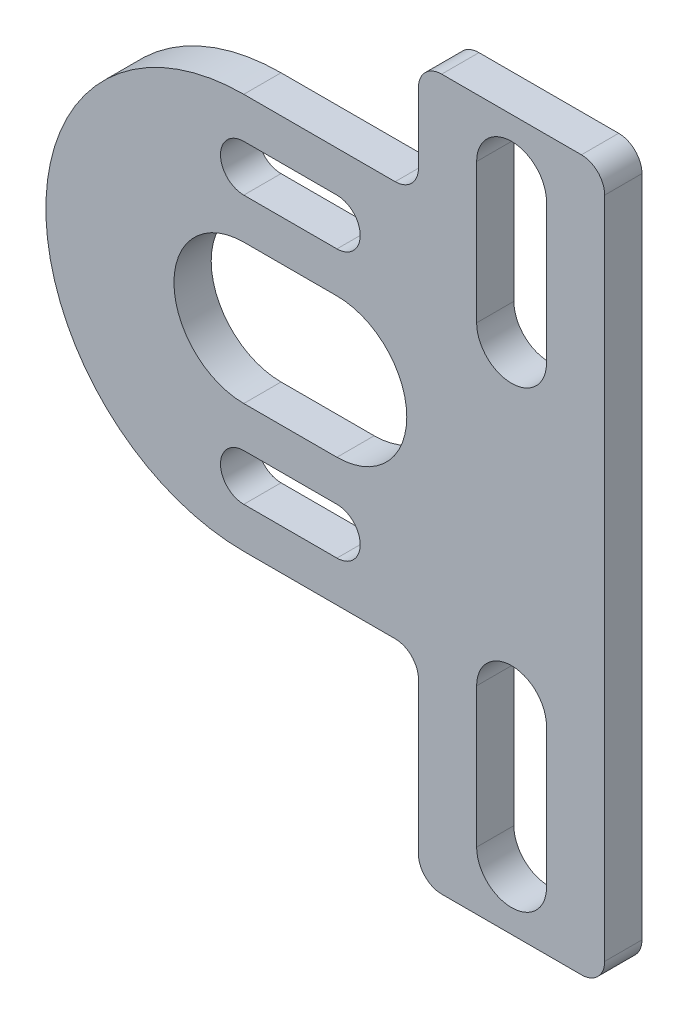
ISO-10303-21;
HEADER;
FILE_DESCRIPTION(('STEP AP214'),'2;1');
FILE_NAME('part.step','',(''),(''),'','','');
FILE_SCHEMA(('AUTOMOTIVE_DESIGN { 1 0 10303 214 1 1 1 1 }'));
ENDSEC;
DATA;
#1=APPLICATION_CONTEXT('core data for automotive mechanical design processes');
#2=APPLICATION_PROTOCOL_DEFINITION('international standard','automotive_design',2000,#1);
#3=PRODUCT_CONTEXT('',#1,'mechanical');
#4=PRODUCT('Part','Part','',(#3));
#5=PRODUCT_RELATED_PRODUCT_CATEGORY('part','',(#4));
#6=PRODUCT_DEFINITION_FORMATION('','',#4);
#7=PRODUCT_DEFINITION_CONTEXT('part definition',#1,'design');
#8=PRODUCT_DEFINITION('design','',#6,#7);
#9=PRODUCT_DEFINITION_SHAPE('','',#8);
#10=(LENGTH_UNIT() NAMED_UNIT(*) SI_UNIT(.MILLI.,.METRE.));
#11=(NAMED_UNIT(*) PLANE_ANGLE_UNIT() SI_UNIT($,.RADIAN.));
#12=(NAMED_UNIT(*) SI_UNIT($,.STERADIAN.) SOLID_ANGLE_UNIT());
#13=UNCERTAINTY_MEASURE_WITH_UNIT(LENGTH_MEASURE(1.E-05),#10,'distance_accuracy_value','');
#14=(GEOMETRIC_REPRESENTATION_CONTEXT(3) GLOBAL_UNCERTAINTY_ASSIGNED_CONTEXT((#13)) GLOBAL_UNIT_ASSIGNED_CONTEXT((#10,
#11,#12)) REPRESENTATION_CONTEXT('',''));
#15=CARTESIAN_POINT('',(0.,0.,0.));
#16=DIRECTION('',(0.,0.,1.));
#17=DIRECTION('',(1.,0.,0.));
#18=AXIS2_PLACEMENT_3D('',#15,#16,#17);
#19=CARTESIAN_POINT('',(-0.5,0.,1.6));
#20=DIRECTION('',(0.,0.,1.));
#21=DIRECTION('',(1.,0.,0.));
#22=AXIS2_PLACEMENT_3D('',#19,#20,#21);
#23=PLANE('',#22);
#24=DIRECTION('',(0.,-1.,0.));
#25=VECTOR('',#24,1.);
#26=CARTESIAN_POINT('',(9.50000000000001,-8.5,1.6));
#27=LINE('',#26,#25);
#28=CARTESIAN_POINT('',(9.50000000000001,-8.5,1.6));
#29=VERTEX_POINT('',#28);
#30=CARTESIAN_POINT('',(9.50000000000001,-14.5,1.6));
#31=VERTEX_POINT('',#30);
#32=EDGE_CURVE('E303',#29,#31,#27,.T.);
#33=ORIENTED_EDGE('',*,*,#32,.F.);
#34=CARTESIAN_POINT('',(11.,-8.5,1.6));
#35=DIRECTION('',(0.,0.,1.));
#36=DIRECTION('',(1.,0.,0.));
#37=AXIS2_PLACEMENT_3D('',#34,#35,#36);
#38=CIRCLE('',#37,1.5);
#39=CARTESIAN_POINT('',(12.5,-8.5,1.6));
#40=VERTEX_POINT('',#39);
#41=EDGE_CURVE('E301',#40,#29,#38,.T.);
#42=ORIENTED_EDGE('',*,*,#41,.F.);
#43=DIRECTION('',(0.,1.,0.));
#44=VECTOR('',#43,1.);
#45=CARTESIAN_POINT('',(12.5,-8.5,1.6));
#46=LINE('',#45,#44);
#47=CARTESIAN_POINT('',(12.5,-14.5,1.6));
#48=VERTEX_POINT('',#47);
#49=EDGE_CURVE('E309',#48,#40,#46,.T.);
#50=ORIENTED_EDGE('',*,*,#49,.F.);
#51=CARTESIAN_POINT('',(11.,-14.5,1.6));
#52=DIRECTION('',(0.,0.,1.));
#53=DIRECTION('',(1.,0.,0.));
#54=AXIS2_PLACEMENT_3D('',#51,#52,#53);
#55=CIRCLE('',#54,1.5);
#56=EDGE_CURVE('E306',#31,#48,#55,.T.);
#57=ORIENTED_EDGE('',*,*,#56,.F.);
#58=EDGE_LOOP('',(#33,#42,#50,#57));
#59=FACE_BOUND('',#58,.T.);
#60=DIRECTION('',(1.,0.,0.));
#61=VECTOR('',#60,1.);
#62=CARTESIAN_POINT('',(-0.500000000000001,-6.75,1.6));
#63=LINE('',#62,#61);
#64=CARTESIAN_POINT('',(-0.500000000000001,-6.75,1.6));
#65=VERTEX_POINT('',#64);
#66=CARTESIAN_POINT('',(3.5,-6.75,1.6));
#67=VERTEX_POINT('',#66);
#68=EDGE_CURVE('E365',#65,#67,#63,.T.);
#69=ORIENTED_EDGE('',*,*,#68,.F.);
#70=CARTESIAN_POINT('',(-0.500000000000001,-5.75,1.6));
#71=DIRECTION('',(0.,0.,1.));
#72=DIRECTION('',(-1.,0.,0.));
#73=AXIS2_PLACEMENT_3D('',#70,#71,#72);
#74=CIRCLE('',#73,1.);
#75=CARTESIAN_POINT('',(-0.500000000000001,-4.75,1.6));
#76=VERTEX_POINT('',#75);
#77=EDGE_CURVE('E363',#76,#65,#74,.T.);
#78=ORIENTED_EDGE('',*,*,#77,.F.);
#79=DIRECTION('',(-1.,0.,0.));
#80=VECTOR('',#79,1.);
#81=CARTESIAN_POINT('',(-0.500000000000001,-4.75,1.6));
#82=LINE('',#81,#80);
#83=CARTESIAN_POINT('',(3.5,-4.75,1.6));
#84=VERTEX_POINT('',#83);
#85=EDGE_CURVE('E371',#84,#76,#82,.T.);
#86=ORIENTED_EDGE('',*,*,#85,.F.);
#87=CARTESIAN_POINT('',(3.5,-5.75,1.6));
#88=DIRECTION('',(0.,0.,1.));
#89=DIRECTION('',(-1.,0.,0.));
#90=AXIS2_PLACEMENT_3D('',#87,#88,#89);
#91=CIRCLE('',#90,1.);
#92=EDGE_CURVE('E368',#67,#84,#91,.T.);
#93=ORIENTED_EDGE('',*,*,#92,.F.);
#94=EDGE_LOOP('',(#69,#78,#86,#93));
#95=FACE_BOUND('',#94,.T.);
#96=DIRECTION('',(0.,1.,0.));
#97=VECTOR('',#96,1.);
#98=CARTESIAN_POINT('',(15.,-17.,1.6));
#99=LINE('',#98,#97);
#100=CARTESIAN_POINT('',(15.,-16.,1.6));
#101=VERTEX_POINT('',#100);
#102=CARTESIAN_POINT('',(15.,12.5,1.6));
#103=VERTEX_POINT('',#102);
#104=EDGE_CURVE('E438',#101,#103,#99,.T.);
#105=ORIENTED_EDGE('',*,*,#104,.T.);
#106=CARTESIAN_POINT('',(14.,12.5,1.6));
#107=DIRECTION('',(0.,0.,1.));
#108=DIRECTION('',(1.,0.,0.));
#109=AXIS2_PLACEMENT_3D('',#106,#107,#108);
#110=CIRCLE('',#109,1.);
#111=CARTESIAN_POINT('',(14.,13.5,1.6));
#112=VERTEX_POINT('',#111);
#113=EDGE_CURVE('E498',#103,#112,#110,.T.);
#114=ORIENTED_EDGE('',*,*,#113,.T.);
#115=DIRECTION('',(-1.,0.,0.));
#116=VECTOR('',#115,1.);
#117=CARTESIAN_POINT('',(15.,13.5,1.6));
#118=LINE('',#117,#116);
#119=CARTESIAN_POINT('',(7.99999999999999,13.5,1.6));
#120=VERTEX_POINT('',#119);
#121=EDGE_CURVE('E441',#112,#120,#118,.T.);
#122=ORIENTED_EDGE('',*,*,#121,.T.);
#123=CARTESIAN_POINT('',(7.99999999999999,12.5,1.6));
#124=DIRECTION('',(0.,0.,1.));
#125=DIRECTION('',(1.,0.,0.));
#126=AXIS2_PLACEMENT_3D('',#123,#124,#125);
#127=CIRCLE('',#126,1.);
#128=CARTESIAN_POINT('',(6.99999999999999,12.5,1.6));
#129=VERTEX_POINT('',#128);
#130=EDGE_CURVE('E494',#120,#129,#127,.T.);
#131=ORIENTED_EDGE('',*,*,#130,.T.);
#132=DIRECTION('',(0.,-1.,0.));
#133=VECTOR('',#132,1.);
#134=CARTESIAN_POINT('',(6.99999999999999,13.5,1.6));
#135=LINE('',#134,#133);
#136=CARTESIAN_POINT('',(7.,9.5,1.6));
#137=VERTEX_POINT('',#136);
#138=EDGE_CURVE('E444',#129,#137,#135,.T.);
#139=ORIENTED_EDGE('',*,*,#138,.T.);
#140=CARTESIAN_POINT('',(6.,9.5,1.6));
#141=DIRECTION('',(0.,0.,1.));
#142=DIRECTION('',(1.,0.,0.));
#143=AXIS2_PLACEMENT_3D('',#140,#141,#142);
#144=CIRCLE('',#143,1.);
#145=CARTESIAN_POINT('',(6.,8.5,1.6));
#146=VERTEX_POINT('',#145);
#147=EDGE_CURVE('E52',#137,#146,#144,.F.);
#148=ORIENTED_EDGE('',*,*,#147,.T.);
#149=DIRECTION('',(-1.,0.,0.));
#150=VECTOR('',#149,1.);
#151=CARTESIAN_POINT('',(-0.5,8.5,1.6));
#152=LINE('',#151,#150);
#153=CARTESIAN_POINT('',(-0.5,8.5,1.6));
#154=VERTEX_POINT('',#153);
#155=EDGE_CURVE('E446',#146,#154,#152,.T.);
#156=ORIENTED_EDGE('',*,*,#155,.T.);
#157=CARTESIAN_POINT('',(-0.5,0.,1.6));
#158=DIRECTION('',(0.,0.,1.));
#159=DIRECTION('',(1.,0.,0.));
#160=AXIS2_PLACEMENT_3D('',#157,#158,#159);
#161=CIRCLE('',#160,8.5);
#162=CARTESIAN_POINT('',(-0.5,-8.5,1.6));
#163=VERTEX_POINT('',#162);
#164=EDGE_CURVE('E425',#154,#163,#161,.T.);
#165=ORIENTED_EDGE('',*,*,#164,.T.);
#166=DIRECTION('',(1.,0.,0.));
#167=VECTOR('',#166,1.);
#168=CARTESIAN_POINT('',(-0.5,-8.5,1.6));
#169=LINE('',#168,#167);
#170=CARTESIAN_POINT('',(6.,-8.5,1.6));
#171=VERTEX_POINT('',#170);
#172=EDGE_CURVE('E428',#163,#171,#169,.T.);
#173=ORIENTED_EDGE('',*,*,#172,.T.);
#174=CARTESIAN_POINT('',(6.,-9.5,1.6));
#175=DIRECTION('',(0.,0.,1.));
#176=DIRECTION('',(1.,0.,0.));
#177=AXIS2_PLACEMENT_3D('',#174,#175,#176);
#178=CIRCLE('',#177,1.);
#179=CARTESIAN_POINT('',(7.,-9.5,1.6));
#180=VERTEX_POINT('',#179);
#181=EDGE_CURVE('E11',#171,#180,#178,.F.);
#182=ORIENTED_EDGE('',*,*,#181,.T.);
#183=DIRECTION('',(0.,-1.,0.));
#184=VECTOR('',#183,1.);
#185=CARTESIAN_POINT('',(7.,-8.5,1.6));
#186=LINE('',#185,#184);
#187=CARTESIAN_POINT('',(7.,-16.,1.6));
#188=VERTEX_POINT('',#187);
#189=EDGE_CURVE('E432',#180,#188,#186,.T.);
#190=ORIENTED_EDGE('',*,*,#189,.T.);
#191=CARTESIAN_POINT('',(8.,-16.,1.6));
#192=DIRECTION('',(0.,0.,1.));
#193=DIRECTION('',(1.,0.,0.));
#194=AXIS2_PLACEMENT_3D('',#191,#192,#193);
#195=CIRCLE('',#194,1.);
#196=CARTESIAN_POINT('',(8.,-17.,1.6));
#197=VERTEX_POINT('',#196);
#198=EDGE_CURVE('E492',#188,#197,#195,.T.);
#199=ORIENTED_EDGE('',*,*,#198,.T.);
#200=DIRECTION('',(1.,0.,0.));
#201=VECTOR('',#200,1.);
#202=CARTESIAN_POINT('',(7.,-17.,1.6));
#203=LINE('',#202,#201);
#204=CARTESIAN_POINT('',(14.,-17.,1.6));
#205=VERTEX_POINT('',#204);
#206=EDGE_CURVE('E435',#197,#205,#203,.T.);
#207=ORIENTED_EDGE('',*,*,#206,.T.);
#208=CARTESIAN_POINT('',(14.,-16.,1.6));
#209=DIRECTION('',(0.,0.,1.));
#210=DIRECTION('',(1.,0.,0.));
#211=AXIS2_PLACEMENT_3D('',#208,#209,#210);
#212=CIRCLE('',#211,1.);
#213=EDGE_CURVE('E496',#205,#101,#212,.T.);
#214=ORIENTED_EDGE('',*,*,#213,.T.);
#215=EDGE_LOOP('',(#105,#114,#122,#131,#139,#148,#156,#165,#173,#182,#190,#199,#207,#214));
#216=FACE_BOUND('',#215,.T.);
#217=DIRECTION('',(1.,0.,0.));
#218=VECTOR('',#217,1.);
#219=CARTESIAN_POINT('',(-0.5,-3.,1.6));
#220=LINE('',#219,#218);
#221=CARTESIAN_POINT('',(-0.5,-3.,1.6));
#222=VERTEX_POINT('',#221);
#223=CARTESIAN_POINT('',(3.5,-3.,1.6));
#224=VERTEX_POINT('',#223);
#225=EDGE_CURVE('E396',#222,#224,#220,.T.);
#226=ORIENTED_EDGE('',*,*,#225,.F.);
#227=CARTESIAN_POINT('',(-0.5,0.,1.6));
#228=DIRECTION('',(0.,0.,1.));
#229=DIRECTION('',(1.,0.,0.));
#230=AXIS2_PLACEMENT_3D('',#227,#228,#229);
#231=CIRCLE('',#230,3.);
#232=CARTESIAN_POINT('',(-0.5,3.,1.6));
#233=VERTEX_POINT('',#232);
#234=EDGE_CURVE('E394',#233,#222,#231,.T.);
#235=ORIENTED_EDGE('',*,*,#234,.F.);
#236=DIRECTION('',(-1.,0.,0.));
#237=VECTOR('',#236,1.);
#238=CARTESIAN_POINT('',(-0.5,3.,1.6));
#239=LINE('',#238,#237);
#240=CARTESIAN_POINT('',(3.5,3.,1.6));
#241=VERTEX_POINT('',#240);
#242=EDGE_CURVE('E402',#241,#233,#239,.T.);
#243=ORIENTED_EDGE('',*,*,#242,.F.);
#244=CARTESIAN_POINT('',(3.5,0.,1.6));
#245=DIRECTION('',(0.,0.,1.));
#246=DIRECTION('',(-1.,0.,0.));
#247=AXIS2_PLACEMENT_3D('',#244,#245,#246);
#248=CIRCLE('',#247,3.);
#249=EDGE_CURVE('E399',#224,#241,#248,.T.);
#250=ORIENTED_EDGE('',*,*,#249,.F.);
#251=EDGE_LOOP('',(#226,#235,#243,#250));
#252=FACE_BOUND('',#251,.T.);
#253=DIRECTION('',(1.,0.,0.));
#254=VECTOR('',#253,1.);
#255=CARTESIAN_POINT('',(-0.500000000000001,4.75,1.6));
#256=LINE('',#255,#254);
#257=CARTESIAN_POINT('',(-0.500000000000001,4.75,1.6));
#258=VERTEX_POINT('',#257);
#259=CARTESIAN_POINT('',(3.5,4.75,1.6));
#260=VERTEX_POINT('',#259);
#261=EDGE_CURVE('E334',#258,#260,#256,.T.);
#262=ORIENTED_EDGE('',*,*,#261,.F.);
#263=CARTESIAN_POINT('',(-0.500000000000001,5.75,1.6));
#264=DIRECTION('',(0.,0.,1.));
#265=DIRECTION('',(1.,0.,0.));
#266=AXIS2_PLACEMENT_3D('',#263,#264,#265);
#267=CIRCLE('',#266,1.);
#268=CARTESIAN_POINT('',(-0.500000000000001,6.75,1.6));
#269=VERTEX_POINT('',#268);
#270=EDGE_CURVE('E332',#269,#258,#267,.T.);
#271=ORIENTED_EDGE('',*,*,#270,.F.);
#272=DIRECTION('',(-1.,0.,0.));
#273=VECTOR('',#272,1.);
#274=CARTESIAN_POINT('',(-0.500000000000001,6.75,1.6));
#275=LINE('',#274,#273);
#276=CARTESIAN_POINT('',(3.5,6.75,1.6));
#277=VERTEX_POINT('',#276);
#278=EDGE_CURVE('E340',#277,#269,#275,.T.);
#279=ORIENTED_EDGE('',*,*,#278,.F.);
#280=CARTESIAN_POINT('',(3.5,5.75,1.6));
#281=DIRECTION('',(0.,0.,1.));
#282=DIRECTION('',(1.,0.,0.));
#283=AXIS2_PLACEMENT_3D('',#280,#281,#282);
#284=CIRCLE('',#283,1.);
#285=EDGE_CURVE('E337',#260,#277,#284,.T.);
#286=ORIENTED_EDGE('',*,*,#285,.F.);
#287=EDGE_LOOP('',(#262,#271,#279,#286));
#288=FACE_BOUND('',#287,.T.);
#289=DIRECTION('',(0.,1.,0.));
#290=VECTOR('',#289,1.);
#291=CARTESIAN_POINT('',(12.5,5.,1.6));
#292=LINE('',#291,#290);
#293=CARTESIAN_POINT('',(12.5,5.,1.6));
#294=VERTEX_POINT('',#293);
#295=CARTESIAN_POINT('',(12.5,11.,1.6));
#296=VERTEX_POINT('',#295);
#297=EDGE_CURVE('E270',#294,#296,#292,.T.);
#298=ORIENTED_EDGE('',*,*,#297,.F.);
#299=CARTESIAN_POINT('',(11.,5.,1.6));
#300=DIRECTION('',(0.,0.,1.));
#301=DIRECTION('',(-1.,0.,0.));
#302=AXIS2_PLACEMENT_3D('',#299,#300,#301);
#303=CIRCLE('',#302,1.50000000000002);
#304=CARTESIAN_POINT('',(9.49999999999999,5.,1.6));
#305=VERTEX_POINT('',#304);
#306=EDGE_CURVE('E260',#305,#294,#303,.T.);
#307=ORIENTED_EDGE('',*,*,#306,.F.);
#308=DIRECTION('',(0.,-1.,0.));
#309=VECTOR('',#308,1.);
#310=CARTESIAN_POINT('',(9.49999999999999,5.,1.6));
#311=LINE('',#310,#309);
#312=CARTESIAN_POINT('',(9.49999999999999,11.,1.6));
#313=VERTEX_POINT('',#312);
#314=EDGE_CURVE('E285',#313,#305,#311,.T.);
#315=ORIENTED_EDGE('',*,*,#314,.F.);
#316=CARTESIAN_POINT('',(11.,11.,1.6));
#317=DIRECTION('',(0.,0.,1.));
#318=DIRECTION('',(-1.,0.,0.));
#319=AXIS2_PLACEMENT_3D('',#316,#317,#318);
#320=CIRCLE('',#319,1.50000000000002);
#321=EDGE_CURVE('E283',#296,#313,#320,.T.);
#322=ORIENTED_EDGE('',*,*,#321,.F.);
#323=EDGE_LOOP('',(#298,#307,#315,#322));
#324=FACE_BOUND('',#323,.T.);
#325=ADVANCED_FACE('F37',(#59,#95,#216,#252,#288,#324),#23,.T.);
#326=CARTESIAN_POINT('',(-0.5,0.,0.));
#327=DIRECTION('',(0.,0.,1.));
#328=DIRECTION('',(1.,0.,0.));
#329=AXIS2_PLACEMENT_3D('',#326,#327,#328);
#330=PLANE('',#329);
#331=CARTESIAN_POINT('',(11.,-8.5,0.));
#332=DIRECTION('',(0.,0.,1.));
#333=DIRECTION('',(1.,0.,0.));
#334=AXIS2_PLACEMENT_3D('',#331,#332,#333);
#335=CIRCLE('',#334,1.5);
#336=CARTESIAN_POINT('',(12.5,-8.5,0.));
#337=VERTEX_POINT('',#336);
#338=CARTESIAN_POINT('',(9.50000000000001,-8.5,0.));
#339=VERTEX_POINT('',#338);
#340=EDGE_CURVE('E278',#337,#339,#335,.T.);
#341=ORIENTED_EDGE('',*,*,#340,.T.);
#342=DIRECTION('',(0.,-1.,0.));
#343=VECTOR('',#342,1.);
#344=CARTESIAN_POINT('',(9.50000000000001,-8.5,0.));
#345=LINE('',#344,#343);
#346=CARTESIAN_POINT('',(9.50000000000001,-14.5,0.));
#347=VERTEX_POINT('',#346);
#348=EDGE_CURVE('E314',#339,#347,#345,.T.);
#349=ORIENTED_EDGE('',*,*,#348,.T.);
#350=CARTESIAN_POINT('',(11.,-14.5,0.));
#351=DIRECTION('',(0.,0.,1.));
#352=DIRECTION('',(1.,0.,0.));
#353=AXIS2_PLACEMENT_3D('',#350,#351,#352);
#354=CIRCLE('',#353,1.5);
#355=CARTESIAN_POINT('',(12.5,-14.5,0.));
#356=VERTEX_POINT('',#355);
#357=EDGE_CURVE('E317',#347,#356,#354,.T.);
#358=ORIENTED_EDGE('',*,*,#357,.T.);
#359=DIRECTION('',(0.,1.,0.));
#360=VECTOR('',#359,1.);
#361=CARTESIAN_POINT('',(12.5,-8.5,0.));
#362=LINE('',#361,#360);
#363=EDGE_CURVE('E304',#356,#337,#362,.T.);
#364=ORIENTED_EDGE('',*,*,#363,.T.);
#365=EDGE_LOOP('',(#341,#349,#358,#364));
#366=FACE_BOUND('',#365,.T.);
#367=CARTESIAN_POINT('',(-0.500000000000001,-5.75,0.));
#368=DIRECTION('',(0.,0.,1.));
#369=DIRECTION('',(-1.,0.,0.));
#370=AXIS2_PLACEMENT_3D('',#367,#368,#369);
#371=CIRCLE('',#370,1.);
#372=CARTESIAN_POINT('',(-0.500000000000001,-4.75,0.));
#373=VERTEX_POINT('',#372);
#374=CARTESIAN_POINT('',(-0.500000000000001,-6.75,0.));
#375=VERTEX_POINT('',#374);
#376=EDGE_CURVE('E362',#373,#375,#371,.T.);
#377=ORIENTED_EDGE('',*,*,#376,.T.);
#378=DIRECTION('',(1.,0.,0.));
#379=VECTOR('',#378,1.);
#380=CARTESIAN_POINT('',(-0.500000000000001,-6.75,0.));
#381=LINE('',#380,#379);
#382=CARTESIAN_POINT('',(3.5,-6.75,0.));
#383=VERTEX_POINT('',#382);
#384=EDGE_CURVE('E376',#375,#383,#381,.T.);
#385=ORIENTED_EDGE('',*,*,#384,.T.);
#386=CARTESIAN_POINT('',(3.5,-5.75,0.));
#387=DIRECTION('',(0.,0.,1.));
#388=DIRECTION('',(-1.,0.,0.));
#389=AXIS2_PLACEMENT_3D('',#386,#387,#388);
#390=CIRCLE('',#389,1.);
#391=CARTESIAN_POINT('',(3.5,-4.75,0.));
#392=VERTEX_POINT('',#391);
#393=EDGE_CURVE('E379',#383,#392,#390,.T.);
#394=ORIENTED_EDGE('',*,*,#393,.T.);
#395=DIRECTION('',(-1.,0.,0.));
#396=VECTOR('',#395,1.);
#397=CARTESIAN_POINT('',(-0.500000000000001,-4.75,0.));
#398=LINE('',#397,#396);
#399=EDGE_CURVE('E366',#392,#373,#398,.T.);
#400=ORIENTED_EDGE('',*,*,#399,.T.);
#401=EDGE_LOOP('',(#377,#385,#394,#400));
#402=FACE_BOUND('',#401,.T.);
#403=DIRECTION('',(-1.,0.,0.));
#404=VECTOR('',#403,1.);
#405=CARTESIAN_POINT('',(15.,13.5,0.));
#406=LINE('',#405,#404);
#407=CARTESIAN_POINT('',(14.,13.5,0.));
#408=VERTEX_POINT('',#407);
#409=CARTESIAN_POINT('',(7.99999999999999,13.5,0.));
#410=VERTEX_POINT('',#409);
#411=EDGE_CURVE('E463',#408,#410,#406,.T.);
#412=ORIENTED_EDGE('',*,*,#411,.F.);
#413=CARTESIAN_POINT('',(14.,12.5,0.));
#414=DIRECTION('',(0.,0.,1.));
#415=DIRECTION('',(1.,0.,0.));
#416=AXIS2_PLACEMENT_3D('',#413,#414,#415);
#417=CIRCLE('',#416,1.);
#418=CARTESIAN_POINT('',(15.,12.5,0.));
#419=VERTEX_POINT('',#418);
#420=EDGE_CURVE('E485',#408,#419,#417,.F.);
#421=ORIENTED_EDGE('',*,*,#420,.T.);
#422=DIRECTION('',(0.,1.,0.));
#423=VECTOR('',#422,1.);
#424=CARTESIAN_POINT('',(15.,-17.,0.));
#425=LINE('',#424,#423);
#426=CARTESIAN_POINT('',(15.,-16.,0.));
#427=VERTEX_POINT('',#426);
#428=EDGE_CURVE('E460',#427,#419,#425,.T.);
#429=ORIENTED_EDGE('',*,*,#428,.F.);
#430=CARTESIAN_POINT('',(14.,-16.,0.));
#431=DIRECTION('',(0.,0.,1.));
#432=DIRECTION('',(1.,0.,0.));
#433=AXIS2_PLACEMENT_3D('',#430,#431,#432);
#434=CIRCLE('',#433,1.);
#435=CARTESIAN_POINT('',(14.,-17.,0.));
#436=VERTEX_POINT('',#435);
#437=EDGE_CURVE('E483',#427,#436,#434,.F.);
#438=ORIENTED_EDGE('',*,*,#437,.T.);
#439=DIRECTION('',(1.,0.,0.));
#440=VECTOR('',#439,1.);
#441=CARTESIAN_POINT('',(7.,-17.,0.));
#442=LINE('',#441,#440);
#443=CARTESIAN_POINT('',(8.,-17.,0.));
#444=VERTEX_POINT('',#443);
#445=EDGE_CURVE('E457',#444,#436,#442,.T.);
#446=ORIENTED_EDGE('',*,*,#445,.F.);
#447=CARTESIAN_POINT('',(8.,-16.,0.));
#448=DIRECTION('',(0.,0.,1.));
#449=DIRECTION('',(1.,0.,0.));
#450=AXIS2_PLACEMENT_3D('',#447,#448,#449);
#451=CIRCLE('',#450,1.);
#452=CARTESIAN_POINT('',(7.,-16.,0.));
#453=VERTEX_POINT('',#452);
#454=EDGE_CURVE('E479',#444,#453,#451,.F.);
#455=ORIENTED_EDGE('',*,*,#454,.T.);
#456=DIRECTION('',(0.,-1.,0.));
#457=VECTOR('',#456,1.);
#458=CARTESIAN_POINT('',(7.,-8.5,0.));
#459=LINE('',#458,#457);
#460=CARTESIAN_POINT('',(7.,-9.5,0.));
#461=VERTEX_POINT('',#460);
#462=EDGE_CURVE('E454',#461,#453,#459,.T.);
#463=ORIENTED_EDGE('',*,*,#462,.F.);
#464=CARTESIAN_POINT('',(6.,-9.5,0.));
#465=DIRECTION('',(0.,0.,1.));
#466=DIRECTION('',(1.,0.,0.));
#467=AXIS2_PLACEMENT_3D('',#464,#465,#466);
#468=CIRCLE('',#467,1.);
#469=CARTESIAN_POINT('',(6.,-8.5,0.));
#470=VERTEX_POINT('',#469);
#471=EDGE_CURVE('E45',#461,#470,#468,.T.);
#472=ORIENTED_EDGE('',*,*,#471,.T.);
#473=DIRECTION('',(1.,0.,0.));
#474=VECTOR('',#473,1.);
#475=CARTESIAN_POINT('',(-0.5,-8.5,0.));
#476=LINE('',#475,#474);
#477=CARTESIAN_POINT('',(-0.5,-8.5,0.));
#478=VERTEX_POINT('',#477);
#479=EDGE_CURVE('E451',#478,#470,#476,.T.);
#480=ORIENTED_EDGE('',*,*,#479,.F.);
#481=CARTESIAN_POINT('',(-0.5,0.,0.));
#482=DIRECTION('',(0.,0.,1.));
#483=DIRECTION('',(1.,0.,0.));
#484=AXIS2_PLACEMENT_3D('',#481,#482,#483);
#485=CIRCLE('',#484,8.5);
#486=CARTESIAN_POINT('',(-0.5,8.5,0.));
#487=VERTEX_POINT('',#486);
#488=EDGE_CURVE('E424',#487,#478,#485,.T.);
#489=ORIENTED_EDGE('',*,*,#488,.F.);
#490=DIRECTION('',(-1.,0.,0.));
#491=VECTOR('',#490,1.);
#492=CARTESIAN_POINT('',(-0.5,8.5,0.));
#493=LINE('',#492,#491);
#494=CARTESIAN_POINT('',(6.,8.5,0.));
#495=VERTEX_POINT('',#494);
#496=EDGE_CURVE('E429',#495,#487,#493,.T.);
#497=ORIENTED_EDGE('',*,*,#496,.F.);
#498=CARTESIAN_POINT('',(6.,9.5,0.));
#499=DIRECTION('',(0.,0.,1.));
#500=DIRECTION('',(1.,0.,0.));
#501=AXIS2_PLACEMENT_3D('',#498,#499,#500);
#502=CIRCLE('',#501,1.);
#503=CARTESIAN_POINT('',(7.,9.5,0.));
#504=VERTEX_POINT('',#503);
#505=EDGE_CURVE('E519',#495,#504,#502,.T.);
#506=ORIENTED_EDGE('',*,*,#505,.T.);
#507=DIRECTION('',(0.,-1.,0.));
#508=VECTOR('',#507,1.);
#509=CARTESIAN_POINT('',(6.99999999999999,13.5,0.));
#510=LINE('',#509,#508);
#511=CARTESIAN_POINT('',(6.99999999999999,12.5,0.));
#512=VERTEX_POINT('',#511);
#513=EDGE_CURVE('E466',#512,#504,#510,.T.);
#514=ORIENTED_EDGE('',*,*,#513,.F.);
#515=CARTESIAN_POINT('',(7.99999999999999,12.5,0.));
#516=DIRECTION('',(0.,0.,1.));
#517=DIRECTION('',(1.,0.,0.));
#518=AXIS2_PLACEMENT_3D('',#515,#516,#517);
#519=CIRCLE('',#518,1.);
#520=EDGE_CURVE('E481',#512,#410,#519,.F.);
#521=ORIENTED_EDGE('',*,*,#520,.T.);
#522=EDGE_LOOP('',(#412,#421,#429,#438,#446,#455,#463,#472,#480,#489,#497,#506,#514,#521));
#523=FACE_BOUND('',#522,.T.);
#524=CARTESIAN_POINT('',(-0.5,0.,0.));
#525=DIRECTION('',(0.,0.,1.));
#526=DIRECTION('',(1.,0.,0.));
#527=AXIS2_PLACEMENT_3D('',#524,#525,#526);
#528=CIRCLE('',#527,3.);
#529=CARTESIAN_POINT('',(-0.5,3.,0.));
#530=VERTEX_POINT('',#529);
#531=CARTESIAN_POINT('',(-0.5,-3.,0.));
#532=VERTEX_POINT('',#531);
#533=EDGE_CURVE('E393',#530,#532,#528,.T.);
#534=ORIENTED_EDGE('',*,*,#533,.T.);
#535=DIRECTION('',(1.,0.,0.));
#536=VECTOR('',#535,1.);
#537=CARTESIAN_POINT('',(-0.5,-3.,0.));
#538=LINE('',#537,#536);
#539=CARTESIAN_POINT('',(3.5,-3.,0.));
#540=VERTEX_POINT('',#539);
#541=EDGE_CURVE('E407',#532,#540,#538,.T.);
#542=ORIENTED_EDGE('',*,*,#541,.T.);
#543=CARTESIAN_POINT('',(3.5,0.,0.));
#544=DIRECTION('',(0.,0.,1.));
#545=DIRECTION('',(-1.,0.,0.));
#546=AXIS2_PLACEMENT_3D('',#543,#544,#545);
#547=CIRCLE('',#546,3.);
#548=CARTESIAN_POINT('',(3.5,3.,0.));
#549=VERTEX_POINT('',#548);
#550=EDGE_CURVE('E410',#540,#549,#547,.T.);
#551=ORIENTED_EDGE('',*,*,#550,.T.);
#552=DIRECTION('',(-1.,0.,0.));
#553=VECTOR('',#552,1.);
#554=CARTESIAN_POINT('',(-0.5,3.,0.));
#555=LINE('',#554,#553);
#556=EDGE_CURVE('E397',#549,#530,#555,.T.);
#557=ORIENTED_EDGE('',*,*,#556,.T.);
#558=EDGE_LOOP('',(#534,#542,#551,#557));
#559=FACE_BOUND('',#558,.T.);
#560=CARTESIAN_POINT('',(-0.500000000000001,5.75,0.));
#561=DIRECTION('',(0.,0.,1.));
#562=DIRECTION('',(1.,0.,0.));
#563=AXIS2_PLACEMENT_3D('',#560,#561,#562);
#564=CIRCLE('',#563,1.);
#565=CARTESIAN_POINT('',(-0.500000000000001,6.75,0.));
#566=VERTEX_POINT('',#565);
#567=CARTESIAN_POINT('',(-0.500000000000001,4.75,0.));
#568=VERTEX_POINT('',#567);
#569=EDGE_CURVE('E331',#566,#568,#564,.T.);
#570=ORIENTED_EDGE('',*,*,#569,.T.);
#571=DIRECTION('',(1.,0.,0.));
#572=VECTOR('',#571,1.);
#573=CARTESIAN_POINT('',(-0.500000000000001,4.75,0.));
#574=LINE('',#573,#572);
#575=CARTESIAN_POINT('',(3.5,4.75,0.));
#576=VERTEX_POINT('',#575);
#577=EDGE_CURVE('E345',#568,#576,#574,.T.);
#578=ORIENTED_EDGE('',*,*,#577,.T.);
#579=CARTESIAN_POINT('',(3.5,5.75,0.));
#580=DIRECTION('',(0.,0.,1.));
#581=DIRECTION('',(1.,0.,0.));
#582=AXIS2_PLACEMENT_3D('',#579,#580,#581);
#583=CIRCLE('',#582,1.);
#584=CARTESIAN_POINT('',(3.5,6.75,0.));
#585=VERTEX_POINT('',#584);
#586=EDGE_CURVE('E348',#576,#585,#583,.T.);
#587=ORIENTED_EDGE('',*,*,#586,.T.);
#588=DIRECTION('',(-1.,0.,0.));
#589=VECTOR('',#588,1.);
#590=CARTESIAN_POINT('',(-0.500000000000001,6.75,0.));
#591=LINE('',#590,#589);
#592=EDGE_CURVE('E335',#585,#566,#591,.T.);
#593=ORIENTED_EDGE('',*,*,#592,.T.);
#594=EDGE_LOOP('',(#570,#578,#587,#593));
#595=FACE_BOUND('',#594,.T.);
#596=CARTESIAN_POINT('',(11.,5.,0.));
#597=DIRECTION('',(0.,0.,1.));
#598=DIRECTION('',(-1.,0.,0.));
#599=AXIS2_PLACEMENT_3D('',#596,#597,#598);
#600=CIRCLE('',#599,1.50000000000002);
#601=CARTESIAN_POINT('',(9.49999999999999,5.,0.));
#602=VERTEX_POINT('',#601);
#603=CARTESIAN_POINT('',(12.5,5.,0.));
#604=VERTEX_POINT('',#603);
#605=EDGE_CURVE('E289',#602,#604,#600,.T.);
#606=ORIENTED_EDGE('',*,*,#605,.T.);
#607=DIRECTION('',(0.,1.,0.));
#608=VECTOR('',#607,1.);
#609=CARTESIAN_POINT('',(12.5,5.,0.));
#610=LINE('',#609,#608);
#611=CARTESIAN_POINT('',(12.5,11.,0.));
#612=VERTEX_POINT('',#611);
#613=EDGE_CURVE('E277',#604,#612,#610,.T.);
#614=ORIENTED_EDGE('',*,*,#613,.T.);
#615=CARTESIAN_POINT('',(11.,11.,0.));
#616=DIRECTION('',(0.,0.,1.));
#617=DIRECTION('',(-1.,0.,0.));
#618=AXIS2_PLACEMENT_3D('',#615,#616,#617);
#619=CIRCLE('',#618,1.50000000000002);
#620=CARTESIAN_POINT('',(9.49999999999999,11.,0.));
#621=VERTEX_POINT('',#620);
#622=EDGE_CURVE('E292',#612,#621,#619,.T.);
#623=ORIENTED_EDGE('',*,*,#622,.T.);
#624=DIRECTION('',(0.,-1.,0.));
#625=VECTOR('',#624,1.);
#626=CARTESIAN_POINT('',(9.49999999999999,5.,0.));
#627=LINE('',#626,#625);
#628=EDGE_CURVE('E271',#621,#602,#627,.T.);
#629=ORIENTED_EDGE('',*,*,#628,.T.);
#630=EDGE_LOOP('',(#606,#614,#623,#629));
#631=FACE_BOUND('',#630,.T.);
#632=ADVANCED_FACE('F524',(#366,#402,#523,#559,#595,#631),#330,.F.);
#633=CARTESIAN_POINT('',(-0.5,0.,1.6));
#634=DIRECTION('',(0.,0.,-1.));
#635=DIRECTION('',(-1.,0.,0.));
#636=AXIS2_PLACEMENT_3D('',#633,#634,#635);
#637=CYLINDRICAL_SURFACE('',#636,8.5);
#638=ORIENTED_EDGE('',*,*,#488,.T.);
#639=DIRECTION('',(0.,0.,-1.));
#640=VECTOR('',#639,1.);
#641=CARTESIAN_POINT('',(-0.5,-8.5,1.6));
#642=LINE('',#641,#640);
#643=EDGE_CURVE('E471',#163,#478,#642,.T.);
#644=ORIENTED_EDGE('',*,*,#643,.F.);
#645=ORIENTED_EDGE('',*,*,#164,.F.);
#646=DIRECTION('',(0.,0.,-1.));
#647=VECTOR('',#646,1.);
#648=CARTESIAN_POINT('',(-0.5,8.5,1.6));
#649=LINE('',#648,#647);
#650=EDGE_CURVE('E448',#154,#487,#649,.T.);
#651=ORIENTED_EDGE('',*,*,#650,.T.);
#652=EDGE_LOOP('',(#638,#644,#645,#651));
#653=FACE_BOUND('',#652,.T.);
#654=ADVANCED_FACE('F580',(#653),#637,.T.);
#655=CARTESIAN_POINT('',(-0.5,-8.5,1.6));
#656=DIRECTION('',(0.,1.,0.));
#657=DIRECTION('',(0.,0.,1.));
#658=AXIS2_PLACEMENT_3D('',#655,#656,#657);
#659=PLANE('',#658);
#660=ORIENTED_EDGE('',*,*,#479,.T.);
#661=DIRECTION('',(0.,0.,-1.));
#662=VECTOR('',#661,1.);
#663=CARTESIAN_POINT('',(6.,-8.5,1.6));
#664=LINE('',#663,#662);
#665=EDGE_CURVE('E517',#470,#171,#664,.F.);
#666=ORIENTED_EDGE('',*,*,#665,.T.);
#667=ORIENTED_EDGE('',*,*,#172,.F.);
#668=ORIENTED_EDGE('',*,*,#643,.T.);
#669=EDGE_LOOP('',(#660,#666,#667,#668));
#670=FACE_BOUND('',#669,.T.);
#671=ADVANCED_FACE('F531',(#670),#659,.F.);
#672=CARTESIAN_POINT('',(7.,-8.5,1.6));
#673=DIRECTION('',(1.,0.,0.));
#674=DIRECTION('',(0.,1.,0.));
#675=AXIS2_PLACEMENT_3D('',#672,#673,#674);
#676=PLANE('',#675);
#677=ORIENTED_EDGE('',*,*,#462,.T.);
#678=DIRECTION('',(0.,0.,-1.));
#679=VECTOR('',#678,1.);
#680=CARTESIAN_POINT('',(7.,-16.,1.6));
#681=LINE('',#680,#679);
#682=EDGE_CURVE('E515',#453,#188,#681,.F.);
#683=ORIENTED_EDGE('',*,*,#682,.T.);
#684=ORIENTED_EDGE('',*,*,#189,.F.);
#685=DIRECTION('',(0.,0.,-1.));
#686=VECTOR('',#685,1.);
#687=CARTESIAN_POINT('',(7.,-9.5,0.));
#688=LINE('',#687,#686);
#689=EDGE_CURVE('E512',#180,#461,#688,.T.);
#690=ORIENTED_EDGE('',*,*,#689,.T.);
#691=EDGE_LOOP('',(#677,#683,#684,#690));
#692=FACE_BOUND('',#691,.T.);
#693=ADVANCED_FACE('F538',(#692),#676,.F.);
#694=CARTESIAN_POINT('',(7.,-17.,1.6));
#695=DIRECTION('',(0.,1.,0.));
#696=DIRECTION('',(0.,0.,1.));
#697=AXIS2_PLACEMENT_3D('',#694,#695,#696);
#698=PLANE('',#697);
#699=ORIENTED_EDGE('',*,*,#445,.T.);
#700=DIRECTION('',(0.,0.,-1.));
#701=VECTOR('',#700,1.);
#702=CARTESIAN_POINT('',(14.,-17.,1.6));
#703=LINE('',#702,#701);
#704=EDGE_CURVE('E503',#436,#205,#703,.F.);
#705=ORIENTED_EDGE('',*,*,#704,.T.);
#706=ORIENTED_EDGE('',*,*,#206,.F.);
#707=DIRECTION('',(0.,0.,-1.));
#708=VECTOR('',#707,1.);
#709=CARTESIAN_POINT('',(8.,-17.,1.6));
#710=LINE('',#709,#708);
#711=EDGE_CURVE('E500',#197,#444,#710,.T.);
#712=ORIENTED_EDGE('',*,*,#711,.T.);
#713=EDGE_LOOP('',(#699,#705,#706,#712));
#714=FACE_BOUND('',#713,.T.);
#715=ADVANCED_FACE('F546',(#714),#698,.F.);
#716=CARTESIAN_POINT('',(15.,-17.,1.6));
#717=DIRECTION('',(-1.,0.,0.));
#718=DIRECTION('',(0.,0.,1.));
#719=AXIS2_PLACEMENT_3D('',#716,#717,#718);
#720=PLANE('',#719);
#721=ORIENTED_EDGE('',*,*,#428,.T.);
#722=DIRECTION('',(0.,0.,-1.));
#723=VECTOR('',#722,1.);
#724=CARTESIAN_POINT('',(15.,12.5,1.6));
#725=LINE('',#724,#723);
#726=EDGE_CURVE('E490',#419,#103,#725,.F.);
#727=ORIENTED_EDGE('',*,*,#726,.T.);
#728=ORIENTED_EDGE('',*,*,#104,.F.);
#729=DIRECTION('',(0.,0.,-1.));
#730=VECTOR('',#729,1.);
#731=CARTESIAN_POINT('',(15.,-16.,1.6));
#732=LINE('',#731,#730);
#733=EDGE_CURVE('E487',#101,#427,#732,.T.);
#734=ORIENTED_EDGE('',*,*,#733,.T.);
#735=EDGE_LOOP('',(#721,#727,#728,#734));
#736=FACE_BOUND('',#735,.T.);
#737=ADVANCED_FACE('F555',(#736),#720,.F.);
#738=CARTESIAN_POINT('',(15.,13.5,1.6));
#739=DIRECTION('',(0.,-1.,0.));
#740=DIRECTION('',(0.,0.,-1.));
#741=AXIS2_PLACEMENT_3D('',#738,#739,#740);
#742=PLANE('',#741);
#743=ORIENTED_EDGE('',*,*,#121,.F.);
#744=DIRECTION('',(0.,0.,-1.));
#745=VECTOR('',#744,1.);
#746=CARTESIAN_POINT('',(14.,13.5,1.6));
#747=LINE('',#746,#745);
#748=EDGE_CURVE('E476',#112,#408,#747,.T.);
#749=ORIENTED_EDGE('',*,*,#748,.T.);
#750=ORIENTED_EDGE('',*,*,#411,.T.);
#751=DIRECTION('',(0.,0.,-1.));
#752=VECTOR('',#751,1.);
#753=CARTESIAN_POINT('',(7.99999999999999,13.5,1.6));
#754=LINE('',#753,#752);
#755=EDGE_CURVE('E474',#410,#120,#754,.F.);
#756=ORIENTED_EDGE('',*,*,#755,.T.);
#757=EDGE_LOOP('',(#743,#749,#750,#756));
#758=FACE_BOUND('',#757,.T.);
#759=ADVANCED_FACE('F564',(#758),#742,.F.);
#760=CARTESIAN_POINT('',(6.99999999999999,13.5,1.6));
#761=DIRECTION('',(1.,0.,0.));
#762=DIRECTION('',(0.,1.,0.));
#763=AXIS2_PLACEMENT_3D('',#760,#761,#762);
#764=PLANE('',#763);
#765=ORIENTED_EDGE('',*,*,#513,.T.);
#766=DIRECTION('',(0.,0.,-1.));
#767=VECTOR('',#766,1.);
#768=CARTESIAN_POINT('',(7.,9.5,1.6));
#769=LINE('',#768,#767);
#770=EDGE_CURVE('E60',#504,#137,#769,.F.);
#771=ORIENTED_EDGE('',*,*,#770,.T.);
#772=ORIENTED_EDGE('',*,*,#138,.F.);
#773=DIRECTION('',(0.,0.,-1.));
#774=VECTOR('',#773,1.);
#775=CARTESIAN_POINT('',(6.99999999999999,12.5,1.6));
#776=LINE('',#775,#774);
#777=EDGE_CURVE('E508',#129,#512,#776,.T.);
#778=ORIENTED_EDGE('',*,*,#777,.T.);
#779=EDGE_LOOP('',(#765,#771,#772,#778));
#780=FACE_BOUND('',#779,.T.);
#781=ADVANCED_FACE('F569',(#780),#764,.F.);
#782=CARTESIAN_POINT('',(-0.5,8.5,1.6));
#783=DIRECTION('',(0.,-1.,0.));
#784=DIRECTION('',(0.,0.,-1.));
#785=AXIS2_PLACEMENT_3D('',#782,#783,#784);
#786=PLANE('',#785);
#787=ORIENTED_EDGE('',*,*,#155,.F.);
#788=DIRECTION('',(0.,0.,-1.));
#789=VECTOR('',#788,1.);
#790=CARTESIAN_POINT('',(6.,8.5,0.));
#791=LINE('',#790,#789);
#792=EDGE_CURVE('E505',#146,#495,#791,.T.);
#793=ORIENTED_EDGE('',*,*,#792,.T.);
#794=ORIENTED_EDGE('',*,*,#496,.T.);
#795=ORIENTED_EDGE('',*,*,#650,.F.);
#796=EDGE_LOOP('',(#787,#793,#794,#795));
#797=FACE_BOUND('',#796,.T.);
#798=ADVANCED_FACE('F576',(#797),#786,.F.);
#799=CARTESIAN_POINT('',(-0.5,0.,1.6));
#800=DIRECTION('',(0.,0.,-1.));
#801=DIRECTION('',(-1.,0.,0.));
#802=AXIS2_PLACEMENT_3D('',#799,#800,#801);
#803=CYLINDRICAL_SURFACE('',#802,3.);
#804=ORIENTED_EDGE('',*,*,#533,.F.);
#805=DIRECTION('',(0.,0.,-1.));
#806=VECTOR('',#805,1.);
#807=CARTESIAN_POINT('',(-0.5,3.,1.6));
#808=LINE('',#807,#806);
#809=EDGE_CURVE('E404',#233,#530,#808,.T.);
#810=ORIENTED_EDGE('',*,*,#809,.F.);
#811=ORIENTED_EDGE('',*,*,#234,.T.);
#812=DIRECTION('',(0.,0.,-1.));
#813=VECTOR('',#812,1.);
#814=CARTESIAN_POINT('',(-0.5,-3.,1.6));
#815=LINE('',#814,#813);
#816=EDGE_CURVE('E421',#222,#532,#815,.T.);
#817=ORIENTED_EDGE('',*,*,#816,.T.);
#818=EDGE_LOOP('',(#804,#810,#811,#817));
#819=FACE_BOUND('',#818,.T.);
#820=ADVANCED_FACE('F599',(#819),#803,.F.);
#821=CARTESIAN_POINT('',(-0.5,-3.,1.6));
#822=DIRECTION('',(0.,1.,0.));
#823=DIRECTION('',(-1.,0.,0.));
#824=AXIS2_PLACEMENT_3D('',#821,#822,#823);
#825=PLANE('',#824);
#826=ORIENTED_EDGE('',*,*,#541,.F.);
#827=ORIENTED_EDGE('',*,*,#816,.F.);
#828=ORIENTED_EDGE('',*,*,#225,.T.);
#829=DIRECTION('',(0.,0.,-1.));
#830=VECTOR('',#829,1.);
#831=CARTESIAN_POINT('',(3.5,-3.,1.6));
#832=LINE('',#831,#830);
#833=EDGE_CURVE('E419',#224,#540,#832,.T.);
#834=ORIENTED_EDGE('',*,*,#833,.T.);
#835=EDGE_LOOP('',(#826,#827,#828,#834));
#836=FACE_BOUND('',#835,.T.);
#837=ADVANCED_FACE('F644',(#836),#825,.T.);
#838=CARTESIAN_POINT('',(3.5,0.,1.6));
#839=DIRECTION('',(0.,0.,-1.));
#840=DIRECTION('',(-1.,0.,0.));
#841=AXIS2_PLACEMENT_3D('',#838,#839,#840);
#842=CYLINDRICAL_SURFACE('',#841,3.);
#843=ORIENTED_EDGE('',*,*,#550,.F.);
#844=ORIENTED_EDGE('',*,*,#833,.F.);
#845=ORIENTED_EDGE('',*,*,#249,.T.);
#846=DIRECTION('',(0.,0.,-1.));
#847=VECTOR('',#846,1.);
#848=CARTESIAN_POINT('',(3.5,3.,1.6));
#849=LINE('',#848,#847);
#850=EDGE_CURVE('E417',#241,#549,#849,.T.);
#851=ORIENTED_EDGE('',*,*,#850,.T.);
#852=EDGE_LOOP('',(#843,#844,#845,#851));
#853=FACE_BOUND('',#852,.T.);
#854=ADVANCED_FACE('F651',(#853),#842,.F.);
#855=CARTESIAN_POINT('',(-0.5,3.,1.6));
#856=DIRECTION('',(0.,-1.,0.));
#857=DIRECTION('',(1.,0.,0.));
#858=AXIS2_PLACEMENT_3D('',#855,#856,#857);
#859=PLANE('',#858);
#860=ORIENTED_EDGE('',*,*,#556,.F.);
#861=ORIENTED_EDGE('',*,*,#850,.F.);
#862=ORIENTED_EDGE('',*,*,#242,.T.);
#863=ORIENTED_EDGE('',*,*,#809,.T.);
#864=EDGE_LOOP('',(#860,#861,#862,#863));
#865=FACE_BOUND('',#864,.T.);
#866=ADVANCED_FACE('F658',(#865),#859,.T.);
#867=CARTESIAN_POINT('',(-0.500000000000001,-5.75,1.6));
#868=DIRECTION('',(0.,0.,-1.));
#869=DIRECTION('',(-1.,0.,0.));
#870=AXIS2_PLACEMENT_3D('',#867,#868,#869);
#871=CYLINDRICAL_SURFACE('',#870,1.);
#872=ORIENTED_EDGE('',*,*,#376,.F.);
#873=DIRECTION('',(0.,0.,-1.));
#874=VECTOR('',#873,1.);
#875=CARTESIAN_POINT('',(-0.500000000000001,-4.75,1.6));
#876=LINE('',#875,#874);
#877=EDGE_CURVE('E373',#76,#373,#876,.T.);
#878=ORIENTED_EDGE('',*,*,#877,.F.);
#879=ORIENTED_EDGE('',*,*,#77,.T.);
#880=DIRECTION('',(0.,0.,-1.));
#881=VECTOR('',#880,1.);
#882=CARTESIAN_POINT('',(-0.500000000000001,-6.75,1.6));
#883=LINE('',#882,#881);
#884=EDGE_CURVE('E390',#65,#375,#883,.T.);
#885=ORIENTED_EDGE('',*,*,#884,.T.);
#886=EDGE_LOOP('',(#872,#878,#879,#885));
#887=FACE_BOUND('',#886,.T.);
#888=ADVANCED_FACE('F666',(#887),#871,.F.);
#889=CARTESIAN_POINT('',(-0.500000000000001,-6.75,1.6));
#890=DIRECTION('',(0.,1.,0.));
#891=DIRECTION('',(-1.,0.,0.));
#892=AXIS2_PLACEMENT_3D('',#889,#890,#891);
#893=PLANE('',#892);
#894=ORIENTED_EDGE('',*,*,#384,.F.);
#895=ORIENTED_EDGE('',*,*,#884,.F.);
#896=ORIENTED_EDGE('',*,*,#68,.T.);
#897=DIRECTION('',(0.,0.,-1.));
#898=VECTOR('',#897,1.);
#899=CARTESIAN_POINT('',(3.5,-6.75,1.6));
#900=LINE('',#899,#898);
#901=EDGE_CURVE('E388',#67,#383,#900,.T.);
#902=ORIENTED_EDGE('',*,*,#901,.T.);
#903=EDGE_LOOP('',(#894,#895,#896,#902));
#904=FACE_BOUND('',#903,.T.);
#905=ADVANCED_FACE('F674',(#904),#893,.T.);
#906=CARTESIAN_POINT('',(3.5,-5.75,1.6));
#907=DIRECTION('',(0.,0.,-1.));
#908=DIRECTION('',(-1.,0.,0.));
#909=AXIS2_PLACEMENT_3D('',#906,#907,#908);
#910=CYLINDRICAL_SURFACE('',#909,1.);
#911=ORIENTED_EDGE('',*,*,#393,.F.);
#912=ORIENTED_EDGE('',*,*,#901,.F.);
#913=ORIENTED_EDGE('',*,*,#92,.T.);
#914=DIRECTION('',(0.,0.,-1.));
#915=VECTOR('',#914,1.);
#916=CARTESIAN_POINT('',(3.5,-4.75,1.6));
#917=LINE('',#916,#915);
#918=EDGE_CURVE('E386',#84,#392,#917,.T.);
#919=ORIENTED_EDGE('',*,*,#918,.T.);
#920=EDGE_LOOP('',(#911,#912,#913,#919));
#921=FACE_BOUND('',#920,.T.);
#922=ADVANCED_FACE('F682',(#921),#910,.F.);
#923=CARTESIAN_POINT('',(-0.500000000000001,-4.75,1.6));
#924=DIRECTION('',(0.,-1.,0.));
#925=DIRECTION('',(1.,0.,0.));
#926=AXIS2_PLACEMENT_3D('',#923,#924,#925);
#927=PLANE('',#926);
#928=ORIENTED_EDGE('',*,*,#399,.F.);
#929=ORIENTED_EDGE('',*,*,#918,.F.);
#930=ORIENTED_EDGE('',*,*,#85,.T.);
#931=ORIENTED_EDGE('',*,*,#877,.T.);
#932=EDGE_LOOP('',(#928,#929,#930,#931));
#933=FACE_BOUND('',#932,.T.);
#934=ADVANCED_FACE('F690',(#933),#927,.T.);
#935=CARTESIAN_POINT('',(-0.500000000000001,5.75,1.6));
#936=DIRECTION('',(0.,0.,-1.));
#937=DIRECTION('',(-1.,0.,0.));
#938=AXIS2_PLACEMENT_3D('',#935,#936,#937);
#939=CYLINDRICAL_SURFACE('',#938,1.);
#940=ORIENTED_EDGE('',*,*,#569,.F.);
#941=DIRECTION('',(0.,0.,-1.));
#942=VECTOR('',#941,1.);
#943=CARTESIAN_POINT('',(-0.500000000000001,6.75,1.6));
#944=LINE('',#943,#942);
#945=EDGE_CURVE('E342',#269,#566,#944,.T.);
#946=ORIENTED_EDGE('',*,*,#945,.F.);
#947=ORIENTED_EDGE('',*,*,#270,.T.);
#948=DIRECTION('',(0.,0.,-1.));
#949=VECTOR('',#948,1.);
#950=CARTESIAN_POINT('',(-0.500000000000001,4.75,1.6));
#951=LINE('',#950,#949);
#952=EDGE_CURVE('E359',#258,#568,#951,.T.);
#953=ORIENTED_EDGE('',*,*,#952,.T.);
#954=EDGE_LOOP('',(#940,#946,#947,#953));
#955=FACE_BOUND('',#954,.T.);
#956=ADVANCED_FACE('F698',(#955),#939,.F.);
#957=CARTESIAN_POINT('',(-0.500000000000001,4.75,1.6));
#958=DIRECTION('',(0.,1.,0.));
#959=DIRECTION('',(-1.,0.,0.));
#960=AXIS2_PLACEMENT_3D('',#957,#958,#959);
#961=PLANE('',#960);
#962=ORIENTED_EDGE('',*,*,#577,.F.);
#963=ORIENTED_EDGE('',*,*,#952,.F.);
#964=ORIENTED_EDGE('',*,*,#261,.T.);
#965=DIRECTION('',(0.,0.,-1.));
#966=VECTOR('',#965,1.);
#967=CARTESIAN_POINT('',(3.5,4.75,1.6));
#968=LINE('',#967,#966);
#969=EDGE_CURVE('E357',#260,#576,#968,.T.);
#970=ORIENTED_EDGE('',*,*,#969,.T.);
#971=EDGE_LOOP('',(#962,#963,#964,#970));
#972=FACE_BOUND('',#971,.T.);
#973=ADVANCED_FACE('F706',(#972),#961,.T.);
#974=CARTESIAN_POINT('',(3.5,5.75,1.6));
#975=DIRECTION('',(0.,0.,-1.));
#976=DIRECTION('',(-1.,0.,0.));
#977=AXIS2_PLACEMENT_3D('',#974,#975,#976);
#978=CYLINDRICAL_SURFACE('',#977,1.);
#979=ORIENTED_EDGE('',*,*,#586,.F.);
#980=ORIENTED_EDGE('',*,*,#969,.F.);
#981=ORIENTED_EDGE('',*,*,#285,.T.);
#982=DIRECTION('',(0.,0.,-1.));
#983=VECTOR('',#982,1.);
#984=CARTESIAN_POINT('',(3.5,6.75,1.6));
#985=LINE('',#984,#983);
#986=EDGE_CURVE('E355',#277,#585,#985,.T.);
#987=ORIENTED_EDGE('',*,*,#986,.T.);
#988=EDGE_LOOP('',(#979,#980,#981,#987));
#989=FACE_BOUND('',#988,.T.);
#990=ADVANCED_FACE('F714',(#989),#978,.F.);
#991=CARTESIAN_POINT('',(-0.500000000000001,6.75,1.6));
#992=DIRECTION('',(0.,-1.,0.));
#993=DIRECTION('',(1.,0.,0.));
#994=AXIS2_PLACEMENT_3D('',#991,#992,#993);
#995=PLANE('',#994);
#996=ORIENTED_EDGE('',*,*,#592,.F.);
#997=ORIENTED_EDGE('',*,*,#986,.F.);
#998=ORIENTED_EDGE('',*,*,#278,.T.);
#999=ORIENTED_EDGE('',*,*,#945,.T.);
#1000=EDGE_LOOP('',(#996,#997,#998,#999));
#1001=FACE_BOUND('',#1000,.T.);
#1002=ADVANCED_FACE('F722',(#1001),#995,.T.);
#1003=CARTESIAN_POINT('',(11.,-8.5,1.6));
#1004=DIRECTION('',(0.,0.,-1.));
#1005=DIRECTION('',(-1.,0.,0.));
#1006=AXIS2_PLACEMENT_3D('',#1003,#1004,#1005);
#1007=CYLINDRICAL_SURFACE('',#1006,1.5);
#1008=ORIENTED_EDGE('',*,*,#340,.F.);
#1009=DIRECTION('',(0.,0.,-1.));
#1010=VECTOR('',#1009,1.);
#1011=CARTESIAN_POINT('',(12.5,-8.5,1.6));
#1012=LINE('',#1011,#1010);
#1013=EDGE_CURVE('E311',#40,#337,#1012,.T.);
#1014=ORIENTED_EDGE('',*,*,#1013,.F.);
#1015=ORIENTED_EDGE('',*,*,#41,.T.);
#1016=DIRECTION('',(0.,0.,-1.));
#1017=VECTOR('',#1016,1.);
#1018=CARTESIAN_POINT('',(9.50000000000001,-8.5,1.6));
#1019=LINE('',#1018,#1017);
#1020=EDGE_CURVE('E328',#29,#339,#1019,.T.);
#1021=ORIENTED_EDGE('',*,*,#1020,.T.);
#1022=EDGE_LOOP('',(#1008,#1014,#1015,#1021));
#1023=FACE_BOUND('',#1022,.T.);
#1024=ADVANCED_FACE('F730',(#1023),#1007,.F.);
#1025=CARTESIAN_POINT('',(9.50000000000001,-8.5,1.6));
#1026=DIRECTION('',(1.,0.,0.));
#1027=DIRECTION('',(0.,1.,0.));
#1028=AXIS2_PLACEMENT_3D('',#1025,#1026,#1027);
#1029=PLANE('',#1028);
#1030=ORIENTED_EDGE('',*,*,#348,.F.);
#1031=ORIENTED_EDGE('',*,*,#1020,.F.);
#1032=ORIENTED_EDGE('',*,*,#32,.T.);
#1033=DIRECTION('',(0.,0.,-1.));
#1034=VECTOR('',#1033,1.);
#1035=CARTESIAN_POINT('',(9.50000000000001,-14.5,1.6));
#1036=LINE('',#1035,#1034);
#1037=EDGE_CURVE('E326',#31,#347,#1036,.T.);
#1038=ORIENTED_EDGE('',*,*,#1037,.T.);
#1039=EDGE_LOOP('',(#1030,#1031,#1032,#1038));
#1040=FACE_BOUND('',#1039,.T.);
#1041=ADVANCED_FACE('F738',(#1040),#1029,.T.);
#1042=CARTESIAN_POINT('',(11.,-14.5,1.6));
#1043=DIRECTION('',(0.,0.,-1.));
#1044=DIRECTION('',(-1.,0.,0.));
#1045=AXIS2_PLACEMENT_3D('',#1042,#1043,#1044);
#1046=CYLINDRICAL_SURFACE('',#1045,1.5);
#1047=ORIENTED_EDGE('',*,*,#357,.F.);
#1048=ORIENTED_EDGE('',*,*,#1037,.F.);
#1049=ORIENTED_EDGE('',*,*,#56,.T.);
#1050=DIRECTION('',(0.,0.,-1.));
#1051=VECTOR('',#1050,1.);
#1052=CARTESIAN_POINT('',(12.5,-14.5,1.6));
#1053=LINE('',#1052,#1051);
#1054=EDGE_CURVE('E324',#48,#356,#1053,.T.);
#1055=ORIENTED_EDGE('',*,*,#1054,.T.);
#1056=EDGE_LOOP('',(#1047,#1048,#1049,#1055));
#1057=FACE_BOUND('',#1056,.T.);
#1058=ADVANCED_FACE('F746',(#1057),#1046,.F.);
#1059=CARTESIAN_POINT('',(12.5,-8.5,1.6));
#1060=DIRECTION('',(-1.,0.,0.));
#1061=DIRECTION('',(0.,-1.,0.));
#1062=AXIS2_PLACEMENT_3D('',#1059,#1060,#1061);
#1063=PLANE('',#1062);
#1064=ORIENTED_EDGE('',*,*,#363,.F.);
#1065=ORIENTED_EDGE('',*,*,#1054,.F.);
#1066=ORIENTED_EDGE('',*,*,#49,.T.);
#1067=ORIENTED_EDGE('',*,*,#1013,.T.);
#1068=EDGE_LOOP('',(#1064,#1065,#1066,#1067));
#1069=FACE_BOUND('',#1068,.T.);
#1070=ADVANCED_FACE('F754',(#1069),#1063,.T.);
#1071=CARTESIAN_POINT('',(11.,5.,1.6));
#1072=DIRECTION('',(0.,0.,-1.));
#1073=DIRECTION('',(-1.,0.,0.));
#1074=AXIS2_PLACEMENT_3D('',#1071,#1072,#1073);
#1075=CYLINDRICAL_SURFACE('',#1074,1.50000000000002);
#1076=ORIENTED_EDGE('',*,*,#605,.F.);
#1077=DIRECTION('',(0.,0.,-1.));
#1078=VECTOR('',#1077,1.);
#1079=CARTESIAN_POINT('',(9.49999999999999,5.,1.6));
#1080=LINE('',#1079,#1078);
#1081=EDGE_CURVE('E266',#305,#602,#1080,.T.);
#1082=ORIENTED_EDGE('',*,*,#1081,.F.);
#1083=ORIENTED_EDGE('',*,*,#306,.T.);
#1084=DIRECTION('',(0.,0.,-1.));
#1085=VECTOR('',#1084,1.);
#1086=CARTESIAN_POINT('',(12.5,5.,1.6));
#1087=LINE('',#1086,#1085);
#1088=EDGE_CURVE('E263',#294,#604,#1087,.T.);
#1089=ORIENTED_EDGE('',*,*,#1088,.T.);
#1090=EDGE_LOOP('',(#1076,#1082,#1083,#1089));
#1091=FACE_BOUND('',#1090,.T.);
#1092=ADVANCED_FACE('F262',(#1091),#1075,.F.);
#1093=CARTESIAN_POINT('',(12.5,5.,1.6));
#1094=DIRECTION('',(-1.,0.,0.));
#1095=DIRECTION('',(0.,-1.,0.));
#1096=AXIS2_PLACEMENT_3D('',#1093,#1094,#1095);
#1097=PLANE('',#1096);
#1098=ORIENTED_EDGE('',*,*,#613,.F.);
#1099=ORIENTED_EDGE('',*,*,#1088,.F.);
#1100=ORIENTED_EDGE('',*,*,#297,.T.);
#1101=DIRECTION('',(0.,0.,-1.));
#1102=VECTOR('',#1101,1.);
#1103=CARTESIAN_POINT('',(12.5,11.,1.6));
#1104=LINE('',#1103,#1102);
#1105=EDGE_CURVE('E279',#296,#612,#1104,.T.);
#1106=ORIENTED_EDGE('',*,*,#1105,.T.);
#1107=EDGE_LOOP('',(#1098,#1099,#1100,#1106));
#1108=FACE_BOUND('',#1107,.T.);
#1109=ADVANCED_FACE('F274',(#1108),#1097,.T.);
#1110=CARTESIAN_POINT('',(11.,11.,1.6));
#1111=DIRECTION('',(0.,0.,-1.));
#1112=DIRECTION('',(-1.,0.,0.));
#1113=AXIS2_PLACEMENT_3D('',#1110,#1111,#1112);
#1114=CYLINDRICAL_SURFACE('',#1113,1.50000000000002);
#1115=ORIENTED_EDGE('',*,*,#622,.F.);
#1116=ORIENTED_EDGE('',*,*,#1105,.F.);
#1117=ORIENTED_EDGE('',*,*,#321,.T.);
#1118=DIRECTION('',(0.,0.,-1.));
#1119=VECTOR('',#1118,1.);
#1120=CARTESIAN_POINT('',(9.49999999999999,11.,1.6));
#1121=LINE('',#1120,#1119);
#1122=EDGE_CURVE('E298',#313,#621,#1121,.T.);
#1123=ORIENTED_EDGE('',*,*,#1122,.T.);
#1124=EDGE_LOOP('',(#1115,#1116,#1117,#1123));
#1125=FACE_BOUND('',#1124,.T.);
#1126=ADVANCED_FACE('F775',(#1125),#1114,.F.);
#1127=CARTESIAN_POINT('',(9.49999999999999,5.,1.6));
#1128=DIRECTION('',(1.,0.,0.));
#1129=DIRECTION('',(0.,1.,0.));
#1130=AXIS2_PLACEMENT_3D('',#1127,#1128,#1129);
#1131=PLANE('',#1130);
#1132=ORIENTED_EDGE('',*,*,#628,.F.);
#1133=ORIENTED_EDGE('',*,*,#1122,.F.);
#1134=ORIENTED_EDGE('',*,*,#314,.T.);
#1135=ORIENTED_EDGE('',*,*,#1081,.T.);
#1136=EDGE_LOOP('',(#1132,#1133,#1134,#1135));
#1137=FACE_BOUND('',#1136,.T.);
#1138=ADVANCED_FACE('F782',(#1137),#1131,.T.);
#1139=CARTESIAN_POINT('',(14.,12.5,1.6));
#1140=DIRECTION('',(0.,0.,-1.));
#1141=DIRECTION('',(-1.,0.,0.));
#1142=AXIS2_PLACEMENT_3D('',#1139,#1140,#1141);
#1143=CYLINDRICAL_SURFACE('',#1142,1.);
#1144=ORIENTED_EDGE('',*,*,#113,.F.);
#1145=ORIENTED_EDGE('',*,*,#726,.F.);
#1146=ORIENTED_EDGE('',*,*,#420,.F.);
#1147=ORIENTED_EDGE('',*,*,#748,.F.);
#1148=EDGE_LOOP('',(#1144,#1145,#1146,#1147));
#1149=FACE_BOUND('',#1148,.T.);
#1150=ADVANCED_FACE('F559',(#1149),#1143,.T.);
#1151=CARTESIAN_POINT('',(14.,-16.,1.6));
#1152=DIRECTION('',(0.,0.,-1.));
#1153=DIRECTION('',(-1.,0.,0.));
#1154=AXIS2_PLACEMENT_3D('',#1151,#1152,#1153);
#1155=CYLINDRICAL_SURFACE('',#1154,1.);
#1156=ORIENTED_EDGE('',*,*,#213,.F.);
#1157=ORIENTED_EDGE('',*,*,#704,.F.);
#1158=ORIENTED_EDGE('',*,*,#437,.F.);
#1159=ORIENTED_EDGE('',*,*,#733,.F.);
#1160=EDGE_LOOP('',(#1156,#1157,#1158,#1159));
#1161=FACE_BOUND('',#1160,.T.);
#1162=ADVANCED_FACE('F550',(#1161),#1155,.T.);
#1163=CARTESIAN_POINT('',(6.,9.5,1.6));
#1164=DIRECTION('',(0.,0.,1.));
#1165=DIRECTION('',(1.,0.,0.));
#1166=AXIS2_PLACEMENT_3D('',#1163,#1164,#1165);
#1167=CYLINDRICAL_SURFACE('',#1166,1.);
#1168=ORIENTED_EDGE('',*,*,#147,.F.);
#1169=ORIENTED_EDGE('',*,*,#770,.F.);
#1170=ORIENTED_EDGE('',*,*,#505,.F.);
#1171=ORIENTED_EDGE('',*,*,#792,.F.);
#1172=EDGE_LOOP('',(#1168,#1169,#1170,#1171));
#1173=FACE_BOUND('',#1172,.T.);
#1174=ADVANCED_FACE('F574',(#1173),#1167,.F.);
#1175=CARTESIAN_POINT('',(7.99999999999999,12.5,1.6));
#1176=DIRECTION('',(0.,0.,-1.));
#1177=DIRECTION('',(-1.,0.,0.));
#1178=AXIS2_PLACEMENT_3D('',#1175,#1176,#1177);
#1179=CYLINDRICAL_SURFACE('',#1178,1.);
#1180=ORIENTED_EDGE('',*,*,#130,.F.);
#1181=ORIENTED_EDGE('',*,*,#755,.F.);
#1182=ORIENTED_EDGE('',*,*,#520,.F.);
#1183=ORIENTED_EDGE('',*,*,#777,.F.);
#1184=EDGE_LOOP('',(#1180,#1181,#1182,#1183));
#1185=FACE_BOUND('',#1184,.T.);
#1186=ADVANCED_FACE('F567',(#1185),#1179,.T.);
#1187=CARTESIAN_POINT('',(8.,-16.,1.6));
#1188=DIRECTION('',(0.,0.,-1.));
#1189=DIRECTION('',(-1.,0.,0.));
#1190=AXIS2_PLACEMENT_3D('',#1187,#1188,#1189);
#1191=CYLINDRICAL_SURFACE('',#1190,1.);
#1192=ORIENTED_EDGE('',*,*,#198,.F.);
#1193=ORIENTED_EDGE('',*,*,#682,.F.);
#1194=ORIENTED_EDGE('',*,*,#454,.F.);
#1195=ORIENTED_EDGE('',*,*,#711,.F.);
#1196=EDGE_LOOP('',(#1192,#1193,#1194,#1195));
#1197=FACE_BOUND('',#1196,.T.);
#1198=ADVANCED_FACE('F541',(#1197),#1191,.T.);
#1199=CARTESIAN_POINT('',(6.,-9.5,1.6));
#1200=DIRECTION('',(0.,0.,1.));
#1201=DIRECTION('',(1.,0.,0.));
#1202=AXIS2_PLACEMENT_3D('',#1199,#1200,#1201);
#1203=CYLINDRICAL_SURFACE('',#1202,1.);
#1204=ORIENTED_EDGE('',*,*,#181,.F.);
#1205=ORIENTED_EDGE('',*,*,#665,.F.);
#1206=ORIENTED_EDGE('',*,*,#471,.F.);
#1207=ORIENTED_EDGE('',*,*,#689,.F.);
#1208=EDGE_LOOP('',(#1204,#1205,#1206,#1207));
#1209=FACE_BOUND('',#1208,.T.);
#1210=ADVANCED_FACE('F39',(#1209),#1203,.F.);
#1211=CLOSED_SHELL('',(#325,#632,#654,#671,#693,#715,#737,#759,#781,#798,#820,#837,#854,#866,
#888,#905,#922,#934,#956,#973,#990,#1002,#1024,#1041,#1058,#1070,#1092,#1109,#1126,#1138,#1150,
#1162,#1174,#1186,#1198,#1210));
#1212=MANIFOLD_SOLID_BREP('B2',#1211);
#1213=ADVANCED_BREP_SHAPE_REPRESENTATION('',(#18,#1212),#14);
#1214=SHAPE_DEFINITION_REPRESENTATION(#9,#1213);
ENDSEC;
END-ISO-10303-21;
